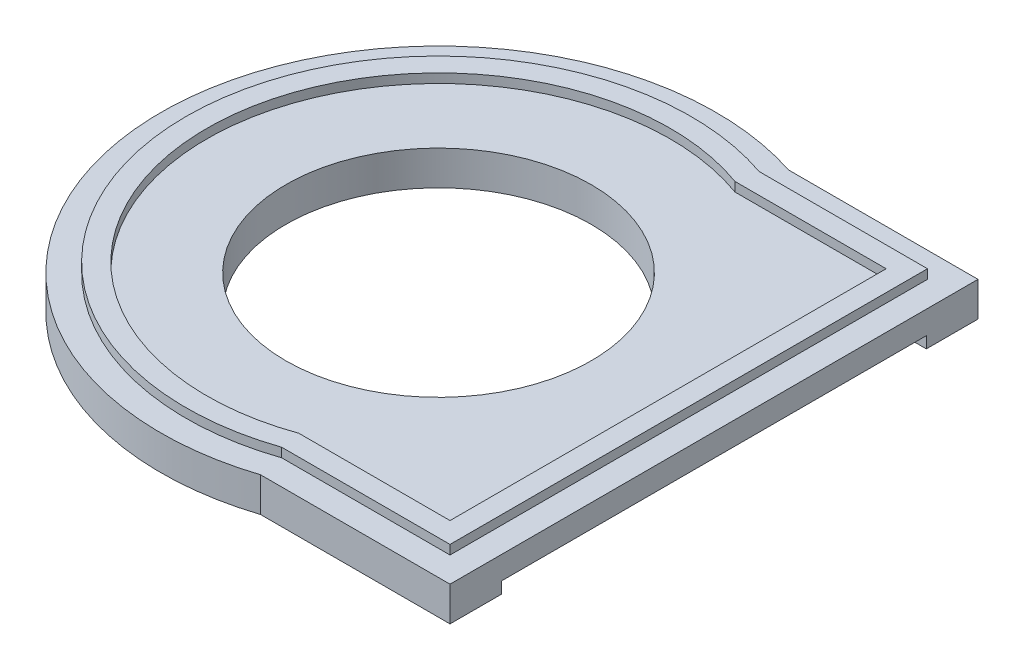
ISO-10303-21;
HEADER;
FILE_DESCRIPTION(('STEP AP214'),'2;1');
FILE_NAME('part.step','',(''),(''),'','','');
FILE_SCHEMA(('AUTOMOTIVE_DESIGN { 1 0 10303 214 1 1 1 1 }'));
ENDSEC;
DATA;
#1=APPLICATION_CONTEXT('core data for automotive mechanical design processes');
#2=APPLICATION_PROTOCOL_DEFINITION('international standard','automotive_design',2000,#1);
#3=PRODUCT_CONTEXT('',#1,'mechanical');
#4=PRODUCT('Part','Part','',(#3));
#5=PRODUCT_RELATED_PRODUCT_CATEGORY('part','',(#4));
#6=PRODUCT_DEFINITION_FORMATION('','',#4);
#7=PRODUCT_DEFINITION_CONTEXT('part definition',#1,'design');
#8=PRODUCT_DEFINITION('design','',#6,#7);
#9=PRODUCT_DEFINITION_SHAPE('','',#8);
#10=(LENGTH_UNIT() NAMED_UNIT(*) SI_UNIT(.MILLI.,.METRE.));
#11=(NAMED_UNIT(*) PLANE_ANGLE_UNIT() SI_UNIT($,.RADIAN.));
#12=(NAMED_UNIT(*) SI_UNIT($,.STERADIAN.) SOLID_ANGLE_UNIT());
#13=UNCERTAINTY_MEASURE_WITH_UNIT(LENGTH_MEASURE(1.E-05),#10,'distance_accuracy_value','');
#14=(GEOMETRIC_REPRESENTATION_CONTEXT(3) GLOBAL_UNCERTAINTY_ASSIGNED_CONTEXT((#13)) GLOBAL_UNIT_ASSIGNED_CONTEXT((#10,
#11,#12)) REPRESENTATION_CONTEXT('',''));
#15=CARTESIAN_POINT('',(0.,0.,0.));
#16=DIRECTION('',(0.,0.,1.));
#17=DIRECTION('',(1.,0.,0.));
#18=AXIS2_PLACEMENT_3D('',#15,#16,#17);
#19=CARTESIAN_POINT('',(0.,1.5,0.));
#20=DIRECTION('',(0.,-1.,0.));
#21=DIRECTION('',(0.,0.,-1.));
#22=AXIS2_PLACEMENT_3D('',#19,#20,#21);
#23=CYLINDRICAL_SURFACE('',#22,12.0948100502085);
#24=CARTESIAN_POINT('',(0.,1.5,0.));
#25=DIRECTION('',(0.,1.,0.));
#26=DIRECTION('',(0.,0.,1.));
#27=AXIS2_PLACEMENT_3D('',#24,#25,#26);
#28=CIRCLE('',#27,12.0948100502085);
#29=CARTESIAN_POINT('',(3.74625548389663,1.5,-11.5));
#30=VERTEX_POINT('',#29);
#31=CARTESIAN_POINT('',(3.74625548389663,1.5,11.5));
#32=VERTEX_POINT('',#31);
#33=EDGE_CURVE('E231',#30,#32,#28,.T.);
#34=ORIENTED_EDGE('',*,*,#33,.F.);
#35=DIRECTION('',(0.,-1.,0.));
#36=VECTOR('',#35,1.);
#37=CARTESIAN_POINT('',(3.74625548389663,1.5,-11.5));
#38=LINE('',#37,#36);
#39=CARTESIAN_POINT('',(3.74625548389663,0.,-11.5));
#40=VERTEX_POINT('',#39);
#41=EDGE_CURVE('E317',#30,#40,#38,.T.);
#42=ORIENTED_EDGE('',*,*,#41,.T.);
#43=CARTESIAN_POINT('',(0.,0.,0.));
#44=DIRECTION('',(0.,1.,0.));
#45=DIRECTION('',(0.,0.,1.));
#46=AXIS2_PLACEMENT_3D('',#43,#44,#45);
#47=CIRCLE('',#46,12.0948100502085);
#48=CARTESIAN_POINT('',(3.74625548389663,0.,11.5));
#49=VERTEX_POINT('',#48);
#50=EDGE_CURVE('E302',#40,#49,#47,.T.);
#51=ORIENTED_EDGE('',*,*,#50,.T.);
#52=DIRECTION('',(0.,-1.,0.));
#53=VECTOR('',#52,1.);
#54=CARTESIAN_POINT('',(3.74625548389663,1.5,11.5));
#55=LINE('',#54,#53);
#56=EDGE_CURVE('E12',#32,#49,#55,.T.);
#57=ORIENTED_EDGE('',*,*,#56,.F.);
#58=EDGE_LOOP('',(#34,#42,#51,#57));
#59=FACE_BOUND('',#58,.T.);
#60=ADVANCED_FACE('F83',(#59),#23,.T.);
#61=CARTESIAN_POINT('',(3.74625548389663,1.5,11.5));
#62=DIRECTION('',(0.,0.,-1.));
#63=DIRECTION('',(-1.,0.,0.));
#64=AXIS2_PLACEMENT_3D('',#61,#62,#63);
#65=PLANE('',#64);
#66=DIRECTION('',(1.,0.,0.));
#67=VECTOR('',#66,1.);
#68=CARTESIAN_POINT('',(3.74625548389663,1.5,11.5));
#69=LINE('',#68,#67);
#70=CARTESIAN_POINT('',(12.,1.5,11.5));
#71=VERTEX_POINT('',#70);
#72=EDGE_CURVE('E236',#32,#71,#69,.T.);
#73=ORIENTED_EDGE('',*,*,#72,.F.);
#74=ORIENTED_EDGE('',*,*,#56,.T.);
#75=DIRECTION('',(1.,0.,0.));
#76=VECTOR('',#75,1.);
#77=CARTESIAN_POINT('',(3.74625548389663,0.,11.5));
#78=LINE('',#77,#76);
#79=CARTESIAN_POINT('',(12.,0.,11.5));
#80=VERTEX_POINT('',#79);
#81=EDGE_CURVE('E307',#49,#80,#78,.T.);
#82=ORIENTED_EDGE('',*,*,#81,.T.);
#83=DIRECTION('',(0.,-1.,0.));
#84=VECTOR('',#83,1.);
#85=CARTESIAN_POINT('',(12.,1.5,11.5));
#86=LINE('',#85,#84);
#87=EDGE_CURVE('E90',#71,#80,#86,.T.);
#88=ORIENTED_EDGE('',*,*,#87,.F.);
#89=EDGE_LOOP('',(#73,#74,#82,#88));
#90=FACE_BOUND('',#89,.T.);
#91=ADVANCED_FACE('F329',(#90),#65,.F.);
#92=CARTESIAN_POINT('',(12.,1.5,11.5));
#93=DIRECTION('',(-1.,0.,0.));
#94=DIRECTION('',(0.,0.,1.));
#95=AXIS2_PLACEMENT_3D('',#92,#93,#94);
#96=PLANE('',#95);
#97=DIRECTION('',(0.,0.,-1.));
#98=VECTOR('',#97,1.);
#99=CARTESIAN_POINT('',(12.,1.5,11.5));
#100=LINE('',#99,#98);
#101=CARTESIAN_POINT('',(12.,1.5,-11.5));
#102=VERTEX_POINT('',#101);
#103=EDGE_CURVE('E97',#71,#102,#100,.T.);
#104=ORIENTED_EDGE('',*,*,#103,.F.);
#105=ORIENTED_EDGE('',*,*,#87,.T.);
#106=DIRECTION('',(0.,0.,-1.));
#107=VECTOR('',#106,1.);
#108=CARTESIAN_POINT('',(12.,0.,11.5));
#109=LINE('',#108,#107);
#110=CARTESIAN_POINT('',(12.,0.,9.25));
#111=VERTEX_POINT('',#110);
#112=EDGE_CURVE('E311',#80,#111,#109,.T.);
#113=ORIENTED_EDGE('',*,*,#112,.T.);
#114=DIRECTION('',(0.,-1.,0.));
#115=VECTOR('',#114,1.);
#116=CARTESIAN_POINT('',(12.,0.5,9.25));
#117=LINE('',#116,#115);
#118=CARTESIAN_POINT('',(12.,0.5,9.25));
#119=VERTEX_POINT('',#118);
#120=EDGE_CURVE('E290',#119,#111,#117,.T.);
#121=ORIENTED_EDGE('',*,*,#120,.F.);
#122=DIRECTION('',(0.,0.,1.));
#123=VECTOR('',#122,1.);
#124=CARTESIAN_POINT('',(12.,0.5,9.25));
#125=LINE('',#124,#123);
#126=CARTESIAN_POINT('',(12.,0.5,-9.25));
#127=VERTEX_POINT('',#126);
#128=EDGE_CURVE('E280',#127,#119,#125,.T.);
#129=ORIENTED_EDGE('',*,*,#128,.F.);
#130=DIRECTION('',(0.,-1.,0.));
#131=VECTOR('',#130,1.);
#132=CARTESIAN_POINT('',(12.,0.5,-9.25));
#133=LINE('',#132,#131);
#134=CARTESIAN_POINT('',(12.,0.,-9.25));
#135=VERTEX_POINT('',#134);
#136=EDGE_CURVE('E293',#127,#135,#133,.T.);
#137=ORIENTED_EDGE('',*,*,#136,.T.);
#138=CARTESIAN_POINT('',(12.,0.,-11.5));
#139=VERTEX_POINT('',#138);
#140=EDGE_CURVE('E310',#135,#139,#109,.T.);
#141=ORIENTED_EDGE('',*,*,#140,.T.);
#142=DIRECTION('',(0.,-1.,0.));
#143=VECTOR('',#142,1.);
#144=CARTESIAN_POINT('',(12.,1.5,-11.5));
#145=LINE('',#144,#143);
#146=EDGE_CURVE('E319',#102,#139,#145,.T.);
#147=ORIENTED_EDGE('',*,*,#146,.F.);
#148=EDGE_LOOP('',(#104,#105,#113,#121,#129,#137,#141,#147));
#149=FACE_BOUND('',#148,.T.);
#150=ADVANCED_FACE('F322',(#149),#96,.F.);
#151=CARTESIAN_POINT('',(3.74625548389663,1.5,-11.5));
#152=DIRECTION('',(0.,0.,1.));
#153=DIRECTION('',(1.,0.,0.));
#154=AXIS2_PLACEMENT_3D('',#151,#152,#153);
#155=PLANE('',#154);
#156=DIRECTION('',(-1.,0.,0.));
#157=VECTOR('',#156,1.);
#158=CARTESIAN_POINT('',(12.,1.5,-11.5));
#159=LINE('',#158,#157);
#160=EDGE_CURVE('E239',#102,#30,#159,.T.);
#161=ORIENTED_EDGE('',*,*,#160,.F.);
#162=ORIENTED_EDGE('',*,*,#146,.T.);
#163=DIRECTION('',(-1.,0.,0.));
#164=VECTOR('',#163,1.);
#165=CARTESIAN_POINT('',(3.74625548389663,0.,-11.5));
#166=LINE('',#165,#164);
#167=EDGE_CURVE('E314',#139,#40,#166,.T.);
#168=ORIENTED_EDGE('',*,*,#167,.T.);
#169=ORIENTED_EDGE('',*,*,#41,.F.);
#170=EDGE_LOOP('',(#161,#162,#168,#169));
#171=FACE_BOUND('',#170,.T.);
#172=ADVANCED_FACE('F352',(#171),#155,.F.);
#173=CARTESIAN_POINT('',(0.,1.9,0.));
#174=DIRECTION('',(0.,1.,0.));
#175=DIRECTION('',(0.,0.,1.));
#176=AXIS2_PLACEMENT_3D('',#173,#174,#175);
#177=PLANE('',#176);
#178=DIRECTION('',(1.,0.,0.));
#179=VECTOR('',#178,1.);
#180=CARTESIAN_POINT('',(3.74625548389663,1.9,9.50000000000001));
#181=LINE('',#180,#179);
#182=CARTESIAN_POINT('',(3.4139698226246,1.9,9.50000000000001));
#183=VERTEX_POINT('',#182);
#184=CARTESIAN_POINT('',(10.,1.9,9.50000000000001));
#185=VERTEX_POINT('',#184);
#186=EDGE_CURVE('E244',#183,#185,#181,.T.);
#187=ORIENTED_EDGE('',*,*,#186,.F.);
#188=CARTESIAN_POINT('',(0.,1.9,0.));
#189=DIRECTION('',(0.,1.,0.));
#190=DIRECTION('',(1.,0.,0.));
#191=AXIS2_PLACEMENT_3D('',#188,#189,#190);
#192=CIRCLE('',#191,10.0948100502085);
#193=CARTESIAN_POINT('',(3.4139698226246,1.9,-9.50000000000001));
#194=VERTEX_POINT('',#193);
#195=EDGE_CURVE('E242',#194,#183,#192,.T.);
#196=ORIENTED_EDGE('',*,*,#195,.F.);
#197=DIRECTION('',(-1.,0.,0.));
#198=VECTOR('',#197,1.);
#199=CARTESIAN_POINT('',(12.,1.9,-9.50000000000001));
#200=LINE('',#199,#198);
#201=CARTESIAN_POINT('',(10.,1.9,-9.50000000000001));
#202=VERTEX_POINT('',#201);
#203=EDGE_CURVE('E250',#202,#194,#200,.T.);
#204=ORIENTED_EDGE('',*,*,#203,.F.);
#205=DIRECTION('',(0.,0.,-1.));
#206=VECTOR('',#205,1.);
#207=CARTESIAN_POINT('',(10.,1.9,11.5));
#208=LINE('',#207,#206);
#209=EDGE_CURVE('E247',#185,#202,#208,.T.);
#210=ORIENTED_EDGE('',*,*,#209,.F.);
#211=EDGE_LOOP('',(#187,#196,#204,#210));
#212=FACE_BOUND('',#211,.T.);
#213=DIRECTION('',(-1.,0.,0.));
#214=VECTOR('',#213,1.);
#215=CARTESIAN_POINT('',(12.,1.9,-10.4));
#216=LINE('',#215,#214);
#217=CARTESIAN_POINT('',(10.9,1.9,-10.4));
#218=VERTEX_POINT('',#217);
#219=CARTESIAN_POINT('',(3.56733066033575,1.9,-10.4));
#220=VERTEX_POINT('',#219);
#221=EDGE_CURVE('E219',#218,#220,#216,.T.);
#222=ORIENTED_EDGE('',*,*,#221,.T.);
#223=CARTESIAN_POINT('',(0.,1.9,0.));
#224=DIRECTION('',(0.,1.,0.));
#225=DIRECTION('',(1.,0.,0.));
#226=AXIS2_PLACEMENT_3D('',#223,#224,#225);
#227=CIRCLE('',#226,10.9948100502085);
#228=CARTESIAN_POINT('',(3.56733066033575,1.9,10.4));
#229=VERTEX_POINT('',#228);
#230=EDGE_CURVE('E226',#220,#229,#227,.T.);
#231=ORIENTED_EDGE('',*,*,#230,.T.);
#232=DIRECTION('',(1.,0.,0.));
#233=VECTOR('',#232,1.);
#234=CARTESIAN_POINT('',(3.74625548389663,1.9,10.4));
#235=LINE('',#234,#233);
#236=CARTESIAN_POINT('',(10.9,1.9,10.4));
#237=VERTEX_POINT('',#236);
#238=EDGE_CURVE('E200',#229,#237,#235,.T.);
#239=ORIENTED_EDGE('',*,*,#238,.T.);
#240=DIRECTION('',(0.,0.,-1.));
#241=VECTOR('',#240,1.);
#242=CARTESIAN_POINT('',(10.9,1.9,11.5));
#243=LINE('',#242,#241);
#244=EDGE_CURVE('E105',#237,#218,#243,.T.);
#245=ORIENTED_EDGE('',*,*,#244,.T.);
#246=EDGE_LOOP('',(#222,#231,#239,#245));
#247=FACE_BOUND('',#246,.T.);
#248=ADVANCED_FACE('F367',(#212,#247),#177,.T.);
#249=CARTESIAN_POINT('',(0.,1.5,0.));
#250=DIRECTION('',(0.,1.,0.));
#251=DIRECTION('',(0.,0.,1.));
#252=AXIS2_PLACEMENT_3D('',#249,#250,#251);
#253=PLANE('',#252);
#254=CARTESIAN_POINT('',(0.,1.5,0.));
#255=DIRECTION('',(0.,1.,0.));
#256=DIRECTION('',(1.,0.,0.));
#257=AXIS2_PLACEMENT_3D('',#254,#255,#256);
#258=CIRCLE('',#257,10.0948100502085);
#259=CARTESIAN_POINT('',(3.4139698226246,1.5,-9.50000000000001));
#260=VERTEX_POINT('',#259);
#261=CARTESIAN_POINT('',(3.4139698226246,1.5,9.50000000000001));
#262=VERTEX_POINT('',#261);
#263=EDGE_CURVE('E241',#260,#262,#258,.T.);
#264=ORIENTED_EDGE('',*,*,#263,.T.);
#265=DIRECTION('',(1.,0.,0.));
#266=VECTOR('',#265,1.);
#267=CARTESIAN_POINT('',(3.74625548389663,1.5,9.50000000000001));
#268=LINE('',#267,#266);
#269=CARTESIAN_POINT('',(10.,1.5,9.50000000000001));
#270=VERTEX_POINT('',#269);
#271=EDGE_CURVE('E254',#262,#270,#268,.T.);
#272=ORIENTED_EDGE('',*,*,#271,.T.);
#273=DIRECTION('',(0.,0.,-1.));
#274=VECTOR('',#273,1.);
#275=CARTESIAN_POINT('',(10.,1.5,11.5));
#276=LINE('',#275,#274);
#277=CARTESIAN_POINT('',(10.,1.5,-9.50000000000001));
#278=VERTEX_POINT('',#277);
#279=EDGE_CURVE('E256',#270,#278,#276,.T.);
#280=ORIENTED_EDGE('',*,*,#279,.T.);
#281=DIRECTION('',(-1.,0.,0.));
#282=VECTOR('',#281,1.);
#283=CARTESIAN_POINT('',(12.,1.5,-9.50000000000001));
#284=LINE('',#283,#282);
#285=EDGE_CURVE('E245',#278,#260,#284,.T.);
#286=ORIENTED_EDGE('',*,*,#285,.T.);
#287=EDGE_LOOP('',(#264,#272,#280,#286));
#288=FACE_BOUND('',#287,.T.);
#289=CARTESIAN_POINT('',(0.,1.5,0.));
#290=DIRECTION('',(0.,1.,0.));
#291=DIRECTION('',(0.,0.,1.));
#292=AXIS2_PLACEMENT_3D('',#289,#290,#291);
#293=CIRCLE('',#292,6.65);
#294=CARTESIAN_POINT('',(0.,1.5,6.65));
#295=VERTEX_POINT('',#294);
#296=EDGE_CURVE('E299',#295,#295,#293,.T.);
#297=ORIENTED_EDGE('',*,*,#296,.F.);
#298=EDGE_LOOP('',(#297));
#299=FACE_BOUND('',#298,.T.);
#300=ADVANCED_FACE('F371',(#288,#299),#253,.T.);
#301=CARTESIAN_POINT('',(0.,0.,0.));
#302=DIRECTION('',(0.,1.,0.));
#303=DIRECTION('',(0.,0.,1.));
#304=AXIS2_PLACEMENT_3D('',#301,#302,#303);
#305=PLANE('',#304);
#306=DIRECTION('',(0.,0.,-1.));
#307=VECTOR('',#306,1.);
#308=CARTESIAN_POINT('',(8.65,0.,-9.25));
#309=LINE('',#308,#307);
#310=CARTESIAN_POINT('',(8.65,0.,9.25));
#311=VERTEX_POINT('',#310);
#312=CARTESIAN_POINT('',(8.65,0.,-9.25));
#313=VERTEX_POINT('',#312);
#314=EDGE_CURVE('E286',#311,#313,#309,.T.);
#315=ORIENTED_EDGE('',*,*,#314,.F.);
#316=DIRECTION('',(-1.,0.,0.));
#317=VECTOR('',#316,1.);
#318=CARTESIAN_POINT('',(8.65,0.,9.25));
#319=LINE('',#318,#317);
#320=EDGE_CURVE('E270',#111,#311,#319,.T.);
#321=ORIENTED_EDGE('',*,*,#320,.F.);
#322=ORIENTED_EDGE('',*,*,#112,.F.);
#323=ORIENTED_EDGE('',*,*,#81,.F.);
#324=ORIENTED_EDGE('',*,*,#50,.F.);
#325=ORIENTED_EDGE('',*,*,#167,.F.);
#326=ORIENTED_EDGE('',*,*,#140,.F.);
#327=DIRECTION('',(1.,0.,0.));
#328=VECTOR('',#327,1.);
#329=CARTESIAN_POINT('',(12.,0.,-9.25));
#330=LINE('',#329,#328);
#331=EDGE_CURVE('E275',#313,#135,#330,.T.);
#332=ORIENTED_EDGE('',*,*,#331,.F.);
#333=EDGE_LOOP('',(#315,#321,#322,#323,#324,#325,#326,#332));
#334=FACE_BOUND('',#333,.T.);
#335=CARTESIAN_POINT('',(0.,0.,0.));
#336=DIRECTION('',(0.,1.,0.));
#337=DIRECTION('',(0.,0.,1.));
#338=AXIS2_PLACEMENT_3D('',#335,#336,#337);
#339=CIRCLE('',#338,6.65);
#340=CARTESIAN_POINT('',(0.,0.,6.65));
#341=VERTEX_POINT('',#340);
#342=EDGE_CURVE('E292',#341,#341,#339,.T.);
#343=ORIENTED_EDGE('',*,*,#342,.T.);
#344=EDGE_LOOP('',(#343));
#345=FACE_BOUND('',#344,.T.);
#346=ADVANCED_FACE('F335',(#334,#345),#305,.F.);
#347=CARTESIAN_POINT('',(0.,1.5,0.));
#348=DIRECTION('',(0.,-1.,0.));
#349=DIRECTION('',(0.,0.,-1.));
#350=AXIS2_PLACEMENT_3D('',#347,#348,#349);
#351=CYLINDRICAL_SURFACE('',#350,6.65);
#352=ORIENTED_EDGE('',*,*,#296,.T.);
#353=EDGE_LOOP('',(#352));
#354=FACE_BOUND('',#353,.T.);
#355=ORIENTED_EDGE('',*,*,#342,.F.);
#356=EDGE_LOOP('',(#355));
#357=FACE_BOUND('',#356,.T.);
#358=ADVANCED_FACE('F370',(#354,#357),#351,.F.);
#359=CARTESIAN_POINT('',(8.65,0.5,9.25));
#360=DIRECTION('',(0.,0.,1.));
#361=DIRECTION('',(1.,0.,0.));
#362=AXIS2_PLACEMENT_3D('',#359,#360,#361);
#363=PLANE('',#362);
#364=ORIENTED_EDGE('',*,*,#320,.T.);
#365=DIRECTION('',(0.,-1.,0.));
#366=VECTOR('',#365,1.);
#367=CARTESIAN_POINT('',(8.65,0.5,9.25));
#368=LINE('',#367,#366);
#369=CARTESIAN_POINT('',(8.65,0.5,9.25));
#370=VERTEX_POINT('',#369);
#371=EDGE_CURVE('E283',#370,#311,#368,.T.);
#372=ORIENTED_EDGE('',*,*,#371,.F.);
#373=DIRECTION('',(-1.,0.,0.));
#374=VECTOR('',#373,1.);
#375=CARTESIAN_POINT('',(8.65,0.5,9.25));
#376=LINE('',#375,#374);
#377=EDGE_CURVE('E271',#119,#370,#376,.T.);
#378=ORIENTED_EDGE('',*,*,#377,.F.);
#379=ORIENTED_EDGE('',*,*,#120,.T.);
#380=EDGE_LOOP('',(#364,#372,#378,#379));
#381=FACE_BOUND('',#380,.T.);
#382=ADVANCED_FACE('F339',(#381),#363,.F.);
#383=CARTESIAN_POINT('',(12.,0.5,-9.25));
#384=DIRECTION('',(0.,0.,-1.));
#385=DIRECTION('',(-1.,0.,0.));
#386=AXIS2_PLACEMENT_3D('',#383,#384,#385);
#387=PLANE('',#386);
#388=ORIENTED_EDGE('',*,*,#331,.T.);
#389=ORIENTED_EDGE('',*,*,#136,.F.);
#390=DIRECTION('',(1.,0.,0.));
#391=VECTOR('',#390,1.);
#392=CARTESIAN_POINT('',(12.,0.5,-9.25));
#393=LINE('',#392,#391);
#394=CARTESIAN_POINT('',(8.65,0.5,-9.25));
#395=VERTEX_POINT('',#394);
#396=EDGE_CURVE('E278',#395,#127,#393,.T.);
#397=ORIENTED_EDGE('',*,*,#396,.F.);
#398=DIRECTION('',(0.,-1.,0.));
#399=VECTOR('',#398,1.);
#400=CARTESIAN_POINT('',(8.65,0.5,-9.25));
#401=LINE('',#400,#399);
#402=EDGE_CURVE('E296',#395,#313,#401,.T.);
#403=ORIENTED_EDGE('',*,*,#402,.T.);
#404=EDGE_LOOP('',(#388,#389,#397,#403));
#405=FACE_BOUND('',#404,.T.);
#406=ADVANCED_FACE('F349',(#405),#387,.F.);
#407=CARTESIAN_POINT('',(8.65,0.5,-9.25));
#408=DIRECTION('',(-1.,0.,0.));
#409=DIRECTION('',(0.,0.,1.));
#410=AXIS2_PLACEMENT_3D('',#407,#408,#409);
#411=PLANE('',#410);
#412=ORIENTED_EDGE('',*,*,#314,.T.);
#413=ORIENTED_EDGE('',*,*,#402,.F.);
#414=DIRECTION('',(0.,0.,-1.));
#415=VECTOR('',#414,1.);
#416=CARTESIAN_POINT('',(8.65,0.5,-9.25));
#417=LINE('',#416,#415);
#418=EDGE_CURVE('E274',#370,#395,#417,.T.);
#419=ORIENTED_EDGE('',*,*,#418,.F.);
#420=ORIENTED_EDGE('',*,*,#371,.T.);
#421=EDGE_LOOP('',(#412,#413,#419,#420));
#422=FACE_BOUND('',#421,.T.);
#423=ADVANCED_FACE('F380',(#422),#411,.F.);
#424=CARTESIAN_POINT('',(0.,0.5,0.));
#425=DIRECTION('',(0.,1.,0.));
#426=DIRECTION('',(0.,0.,1.));
#427=AXIS2_PLACEMENT_3D('',#424,#425,#426);
#428=PLANE('',#427);
#429=ORIENTED_EDGE('',*,*,#377,.T.);
#430=ORIENTED_EDGE('',*,*,#418,.T.);
#431=ORIENTED_EDGE('',*,*,#396,.T.);
#432=ORIENTED_EDGE('',*,*,#128,.T.);
#433=EDGE_LOOP('',(#429,#430,#431,#432));
#434=FACE_BOUND('',#433,.T.);
#435=ADVANCED_FACE('F346',(#434),#428,.F.);
#436=CARTESIAN_POINT('',(0.,1.9,0.));
#437=DIRECTION('',(0.,-1.,0.));
#438=DIRECTION('',(0.,0.,-1.));
#439=AXIS2_PLACEMENT_3D('',#436,#437,#438);
#440=CYLINDRICAL_SURFACE('',#439,10.0948100502085);
#441=ORIENTED_EDGE('',*,*,#263,.F.);
#442=DIRECTION('',(0.,-1.,0.));
#443=VECTOR('',#442,1.);
#444=CARTESIAN_POINT('',(3.4139698226246,1.9,-9.50000000000001));
#445=LINE('',#444,#443);
#446=EDGE_CURVE('E252',#194,#260,#445,.T.);
#447=ORIENTED_EDGE('',*,*,#446,.F.);
#448=ORIENTED_EDGE('',*,*,#195,.T.);
#449=DIRECTION('',(0.,-1.,0.));
#450=VECTOR('',#449,1.);
#451=CARTESIAN_POINT('',(3.4139698226246,1.9,9.50000000000001));
#452=LINE('',#451,#450);
#453=EDGE_CURVE('E267',#183,#262,#452,.T.);
#454=ORIENTED_EDGE('',*,*,#453,.T.);
#455=EDGE_LOOP('',(#441,#447,#448,#454));
#456=FACE_BOUND('',#455,.T.);
#457=ADVANCED_FACE('F388',(#456),#440,.F.);
#458=CARTESIAN_POINT('',(3.74625548389663,1.9,9.50000000000001));
#459=DIRECTION('',(0.,0.,-1.));
#460=DIRECTION('',(-1.,0.,0.));
#461=AXIS2_PLACEMENT_3D('',#458,#459,#460);
#462=PLANE('',#461);
#463=ORIENTED_EDGE('',*,*,#271,.F.);
#464=ORIENTED_EDGE('',*,*,#453,.F.);
#465=ORIENTED_EDGE('',*,*,#186,.T.);
#466=DIRECTION('',(0.,-1.,0.));
#467=VECTOR('',#466,1.);
#468=CARTESIAN_POINT('',(10.,1.9,9.50000000000001));
#469=LINE('',#468,#467);
#470=EDGE_CURVE('E264',#185,#270,#469,.T.);
#471=ORIENTED_EDGE('',*,*,#470,.T.);
#472=EDGE_LOOP('',(#463,#464,#465,#471));
#473=FACE_BOUND('',#472,.T.);
#474=ADVANCED_FACE('F394',(#473),#462,.T.);
#475=CARTESIAN_POINT('',(10.,1.9,11.5));
#476=DIRECTION('',(-1.,0.,0.));
#477=DIRECTION('',(0.,0.,1.));
#478=AXIS2_PLACEMENT_3D('',#475,#476,#477);
#479=PLANE('',#478);
#480=ORIENTED_EDGE('',*,*,#279,.F.);
#481=ORIENTED_EDGE('',*,*,#470,.F.);
#482=ORIENTED_EDGE('',*,*,#209,.T.);
#483=DIRECTION('',(0.,-1.,0.));
#484=VECTOR('',#483,1.);
#485=CARTESIAN_POINT('',(10.,1.9,-9.50000000000001));
#486=LINE('',#485,#484);
#487=EDGE_CURVE('E261',#202,#278,#486,.T.);
#488=ORIENTED_EDGE('',*,*,#487,.T.);
#489=EDGE_LOOP('',(#480,#481,#482,#488));
#490=FACE_BOUND('',#489,.T.);
#491=ADVANCED_FACE('F398',(#490),#479,.T.);
#492=CARTESIAN_POINT('',(12.,1.9,-9.50000000000001));
#493=DIRECTION('',(0.,0.,1.));
#494=DIRECTION('',(1.,0.,0.));
#495=AXIS2_PLACEMENT_3D('',#492,#493,#494);
#496=PLANE('',#495);
#497=ORIENTED_EDGE('',*,*,#285,.F.);
#498=ORIENTED_EDGE('',*,*,#487,.F.);
#499=ORIENTED_EDGE('',*,*,#203,.T.);
#500=ORIENTED_EDGE('',*,*,#446,.T.);
#501=EDGE_LOOP('',(#497,#498,#499,#500));
#502=FACE_BOUND('',#501,.T.);
#503=ADVANCED_FACE('F402',(#502),#496,.T.);
#504=CARTESIAN_POINT('',(0.,1.5,0.));
#505=DIRECTION('',(0.,1.,0.));
#506=DIRECTION('',(0.,0.,1.));
#507=AXIS2_PLACEMENT_3D('',#504,#505,#506);
#508=PLANE('',#507);
#509=DIRECTION('',(-1.,0.,0.));
#510=VECTOR('',#509,1.);
#511=CARTESIAN_POINT('',(12.,1.5,-10.4));
#512=LINE('',#511,#510);
#513=CARTESIAN_POINT('',(10.9,1.5,-10.4));
#514=VERTEX_POINT('',#513);
#515=CARTESIAN_POINT('',(3.56733066033575,1.5,-10.4));
#516=VERTEX_POINT('',#515);
#517=EDGE_CURVE('E206',#514,#516,#512,.T.);
#518=ORIENTED_EDGE('',*,*,#517,.F.);
#519=DIRECTION('',(0.,0.,-1.));
#520=VECTOR('',#519,1.);
#521=CARTESIAN_POINT('',(10.9,1.5,11.5));
#522=LINE('',#521,#520);
#523=CARTESIAN_POINT('',(10.9,1.5,10.4));
#524=VERTEX_POINT('',#523);
#525=EDGE_CURVE('E215',#524,#514,#522,.T.);
#526=ORIENTED_EDGE('',*,*,#525,.F.);
#527=DIRECTION('',(1.,0.,0.));
#528=VECTOR('',#527,1.);
#529=CARTESIAN_POINT('',(3.74625548389663,1.5,10.4));
#530=LINE('',#529,#528);
#531=CARTESIAN_POINT('',(3.56733066033575,1.5,10.4));
#532=VERTEX_POINT('',#531);
#533=EDGE_CURVE('E198',#532,#524,#530,.T.);
#534=ORIENTED_EDGE('',*,*,#533,.F.);
#535=CARTESIAN_POINT('',(0.,1.5,0.));
#536=DIRECTION('',(0.,1.,0.));
#537=DIRECTION('',(1.,0.,0.));
#538=AXIS2_PLACEMENT_3D('',#535,#536,#537);
#539=CIRCLE('',#538,10.9948100502085);
#540=EDGE_CURVE('E212',#516,#532,#539,.T.);
#541=ORIENTED_EDGE('',*,*,#540,.F.);
#542=EDGE_LOOP('',(#518,#526,#534,#541));
#543=FACE_BOUND('',#542,.T.);
#544=ORIENTED_EDGE('',*,*,#33,.T.);
#545=ORIENTED_EDGE('',*,*,#72,.T.);
#546=ORIENTED_EDGE('',*,*,#103,.T.);
#547=ORIENTED_EDGE('',*,*,#160,.T.);
#548=EDGE_LOOP('',(#544,#545,#546,#547));
#549=FACE_BOUND('',#548,.T.);
#550=ADVANCED_FACE('F211',(#543,#549),#508,.T.);
#551=CARTESIAN_POINT('',(0.,1.5,0.));
#552=DIRECTION('',(0.,1.,0.));
#553=DIRECTION('',(0.,0.,1.));
#554=AXIS2_PLACEMENT_3D('',#551,#552,#553);
#555=CYLINDRICAL_SURFACE('',#554,10.9948100502085);
#556=ORIENTED_EDGE('',*,*,#230,.F.);
#557=DIRECTION('',(0.,1.,0.));
#558=VECTOR('',#557,1.);
#559=CARTESIAN_POINT('',(3.56733066033575,1.5,-10.4));
#560=LINE('',#559,#558);
#561=EDGE_CURVE('E218',#516,#220,#560,.T.);
#562=ORIENTED_EDGE('',*,*,#561,.F.);
#563=ORIENTED_EDGE('',*,*,#540,.T.);
#564=DIRECTION('',(0.,1.,0.));
#565=VECTOR('',#564,1.);
#566=CARTESIAN_POINT('',(3.56733066033575,1.5,10.4));
#567=LINE('',#566,#565);
#568=EDGE_CURVE('E195',#532,#229,#567,.T.);
#569=ORIENTED_EDGE('',*,*,#568,.T.);
#570=EDGE_LOOP('',(#556,#562,#563,#569));
#571=FACE_BOUND('',#570,.T.);
#572=ADVANCED_FACE('F217',(#571),#555,.T.);
#573=CARTESIAN_POINT('',(12.,1.5,-10.4));
#574=DIRECTION('',(0.,0.,-1.));
#575=DIRECTION('',(-1.,0.,0.));
#576=AXIS2_PLACEMENT_3D('',#573,#574,#575);
#577=PLANE('',#576);
#578=ORIENTED_EDGE('',*,*,#221,.F.);
#579=DIRECTION('',(0.,1.,0.));
#580=VECTOR('',#579,1.);
#581=CARTESIAN_POINT('',(10.9,1.5,-10.4));
#582=LINE('',#581,#580);
#583=EDGE_CURVE('E232',#514,#218,#582,.T.);
#584=ORIENTED_EDGE('',*,*,#583,.F.);
#585=ORIENTED_EDGE('',*,*,#517,.T.);
#586=ORIENTED_EDGE('',*,*,#561,.T.);
#587=EDGE_LOOP('',(#578,#584,#585,#586));
#588=FACE_BOUND('',#587,.T.);
#589=ADVANCED_FACE('F411',(#588),#577,.T.);
#590=CARTESIAN_POINT('',(10.9,1.5,11.5));
#591=DIRECTION('',(1.,0.,0.));
#592=DIRECTION('',(0.,0.,-1.));
#593=AXIS2_PLACEMENT_3D('',#590,#591,#592);
#594=PLANE('',#593);
#595=ORIENTED_EDGE('',*,*,#244,.F.);
#596=DIRECTION('',(0.,1.,0.));
#597=VECTOR('',#596,1.);
#598=CARTESIAN_POINT('',(10.9,1.5,10.4));
#599=LINE('',#598,#597);
#600=EDGE_CURVE('E205',#524,#237,#599,.T.);
#601=ORIENTED_EDGE('',*,*,#600,.F.);
#602=ORIENTED_EDGE('',*,*,#525,.T.);
#603=ORIENTED_EDGE('',*,*,#583,.T.);
#604=EDGE_LOOP('',(#595,#601,#602,#603));
#605=FACE_BOUND('',#604,.T.);
#606=ADVANCED_FACE('F414',(#605),#594,.T.);
#607=CARTESIAN_POINT('',(3.74625548389663,1.5,10.4));
#608=DIRECTION('',(0.,0.,1.));
#609=DIRECTION('',(1.,0.,0.));
#610=AXIS2_PLACEMENT_3D('',#607,#608,#609);
#611=PLANE('',#610);
#612=ORIENTED_EDGE('',*,*,#238,.F.);
#613=ORIENTED_EDGE('',*,*,#568,.F.);
#614=ORIENTED_EDGE('',*,*,#533,.T.);
#615=ORIENTED_EDGE('',*,*,#600,.T.);
#616=EDGE_LOOP('',(#612,#613,#614,#615));
#617=FACE_BOUND('',#616,.T.);
#618=ADVANCED_FACE('F197',(#617),#611,.T.);
#619=CLOSED_SHELL('',(#60,#91,#150,#172,#248,#300,#346,#358,#382,#406,#423,#435,#457,#474,#491,
#503,#550,#572,#589,#606,#618));
#620=MANIFOLD_SOLID_BREP('B2',#619);
#621=ADVANCED_BREP_SHAPE_REPRESENTATION('',(#18,#620),#14);
#622=SHAPE_DEFINITION_REPRESENTATION(#9,#621);
ENDSEC;
END-ISO-10303-21;
